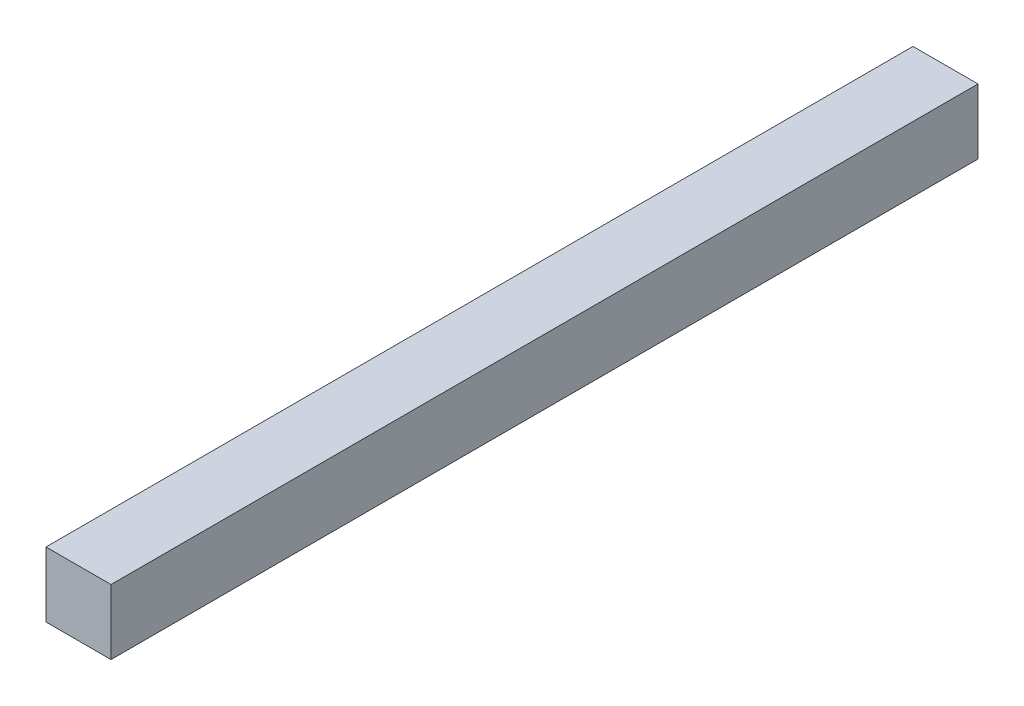
ISO-10303-21;
HEADER;
FILE_DESCRIPTION(('STEP AP214'),'2;1');
FILE_NAME('part.step','',(''),(''),'','','');
FILE_SCHEMA(('AUTOMOTIVE_DESIGN { 1 0 10303 214 1 1 1 1 }'));
ENDSEC;
DATA;
#1=APPLICATION_CONTEXT('core data for automotive mechanical design processes');
#2=APPLICATION_PROTOCOL_DEFINITION('international standard','automotive_design',2000,#1);
#3=PRODUCT_CONTEXT('',#1,'mechanical');
#4=PRODUCT('Part','Part','',(#3));
#5=PRODUCT_RELATED_PRODUCT_CATEGORY('part','',(#4));
#6=PRODUCT_DEFINITION_FORMATION('','',#4);
#7=PRODUCT_DEFINITION_CONTEXT('part definition',#1,'design');
#8=PRODUCT_DEFINITION('design','',#6,#7);
#9=PRODUCT_DEFINITION_SHAPE('','',#8);
#10=(LENGTH_UNIT() NAMED_UNIT(*) SI_UNIT(.MILLI.,.METRE.));
#11=(NAMED_UNIT(*) PLANE_ANGLE_UNIT() SI_UNIT($,.RADIAN.));
#12=(NAMED_UNIT(*) SI_UNIT($,.STERADIAN.) SOLID_ANGLE_UNIT());
#13=UNCERTAINTY_MEASURE_WITH_UNIT(LENGTH_MEASURE(1.E-05),#10,'distance_accuracy_value','');
#14=(GEOMETRIC_REPRESENTATION_CONTEXT(3) GLOBAL_UNCERTAINTY_ASSIGNED_CONTEXT((#13)) GLOBAL_UNIT_ASSIGNED_CONTEXT((#10,
#11,#12)) REPRESENTATION_CONTEXT('',''));
#15=CARTESIAN_POINT('',(0.,0.,0.));
#16=DIRECTION('',(0.,0.,1.));
#17=DIRECTION('',(1.,0.,0.));
#18=AXIS2_PLACEMENT_3D('',#15,#16,#17);
#19=CARTESIAN_POINT('',(-98.3544303797468,-0.0100000000000031,7.15189873417722));
#20=DIRECTION('',(0.,0.,1.));
#21=DIRECTION('',(1.,0.,0.));
#22=AXIS2_PLACEMENT_3D('',#19,#20,#21);
#23=PLANE('',#22);
#24=DIRECTION('',(0.,-1.,0.));
#25=VECTOR('',#24,1.);
#26=CARTESIAN_POINT('',(-98.3544303797468,50.,7.15189873417722));
#27=LINE('',#26,#25);
#28=CARTESIAN_POINT('',(-98.3544303797468,3.,7.15189873417722));
#29=VERTEX_POINT('',#28);
#30=CARTESIAN_POINT('',(-98.3544303797468,0.,7.15189873417722));
#31=VERTEX_POINT('',#30);
#32=EDGE_CURVE('E89',#29,#31,#27,.T.);
#33=ORIENTED_EDGE('',*,*,#32,.T.);
#34=DIRECTION('',(1.,0.,0.));
#35=VECTOR('',#34,1.);
#36=CARTESIAN_POINT('',(0.,0.,7.15189873417733));
#37=LINE('',#36,#35);
#38=CARTESIAN_POINT('',(-95.3544303797468,0.,7.15189873417722));
#39=VERTEX_POINT('',#38);
#40=EDGE_CURVE('E91',#31,#39,#37,.T.);
#41=ORIENTED_EDGE('',*,*,#40,.T.);
#42=DIRECTION('',(0.,1.,0.));
#43=VECTOR('',#42,1.);
#44=CARTESIAN_POINT('',(-95.3544303797468,-0.0100000000000031,7.15189873417722));
#45=LINE('',#44,#43);
#46=CARTESIAN_POINT('',(-95.3544303797468,3.,7.15189873417722));
#47=VERTEX_POINT('',#46);
#48=EDGE_CURVE('E41',#39,#47,#45,.T.);
#49=ORIENTED_EDGE('',*,*,#48,.T.);
#50=DIRECTION('',(1.,0.,0.));
#51=VECTOR('',#50,1.);
#52=CARTESIAN_POINT('',(0.,3.,7.15189873417733));
#53=LINE('',#52,#51);
#54=EDGE_CURVE('E78',#29,#47,#53,.T.);
#55=ORIENTED_EDGE('',*,*,#54,.F.);
#56=EDGE_LOOP('',(#33,#41,#49,#55));
#57=FACE_BOUND('',#56,.T.);
#58=ADVANCED_FACE('F32',(#57),#23,.T.);
#59=CARTESIAN_POINT('',(-98.3544303797468,-0.0100000000000031,-32.8481012658228));
#60=DIRECTION('',(0.,0.,-1.));
#61=DIRECTION('',(-1.,0.,0.));
#62=AXIS2_PLACEMENT_3D('',#59,#60,#61);
#63=PLANE('',#62);
#64=DIRECTION('',(0.,1.,0.));
#65=VECTOR('',#64,1.);
#66=CARTESIAN_POINT('',(-95.3544303797468,-0.0100000000000031,-32.8481012658228));
#67=LINE('',#66,#65);
#68=CARTESIAN_POINT('',(-95.3544303797468,0.,-32.8481012658228));
#69=VERTEX_POINT('',#68);
#70=CARTESIAN_POINT('',(-95.3544303797468,3.,-32.8481012658228));
#71=VERTEX_POINT('',#70);
#72=EDGE_CURVE('E11',#69,#71,#67,.T.);
#73=ORIENTED_EDGE('',*,*,#72,.F.);
#74=DIRECTION('',(-1.,0.,0.));
#75=VECTOR('',#74,1.);
#76=CARTESIAN_POINT('',(0.,0.,-32.8481012658228));
#77=LINE('',#76,#75);
#78=CARTESIAN_POINT('',(-98.3544303797468,0.,-32.8481012658228));
#79=VERTEX_POINT('',#78);
#80=EDGE_CURVE('E95',#69,#79,#77,.T.);
#81=ORIENTED_EDGE('',*,*,#80,.T.);
#82=DIRECTION('',(0.,1.,0.));
#83=VECTOR('',#82,1.);
#84=CARTESIAN_POINT('',(-98.3544303797468,50.,-32.8481012658228));
#85=LINE('',#84,#83);
#86=CARTESIAN_POINT('',(-98.3544303797468,3.,-32.8481012658228));
#87=VERTEX_POINT('',#86);
#88=EDGE_CURVE('E36',#79,#87,#85,.T.);
#89=ORIENTED_EDGE('',*,*,#88,.T.);
#90=DIRECTION('',(-1.,0.,0.));
#91=VECTOR('',#90,1.);
#92=CARTESIAN_POINT('',(0.,3.,-32.8481012658228));
#93=LINE('',#92,#91);
#94=EDGE_CURVE('E79',#71,#87,#93,.T.);
#95=ORIENTED_EDGE('',*,*,#94,.F.);
#96=EDGE_LOOP('',(#73,#81,#89,#95));
#97=FACE_BOUND('',#96,.T.);
#98=ADVANCED_FACE('F105',(#97),#63,.T.);
#99=CARTESIAN_POINT('',(-95.3544303797468,-0.0100000000000031,-32.8481012658228));
#100=DIRECTION('',(1.,0.,0.));
#101=DIRECTION('',(0.,0.,-1.));
#102=AXIS2_PLACEMENT_3D('',#99,#100,#101);
#103=PLANE('',#102);
#104=ORIENTED_EDGE('',*,*,#48,.F.);
#105=DIRECTION('',(0.,0.,-1.));
#106=VECTOR('',#105,1.);
#107=CARTESIAN_POINT('',(-95.3544303797468,0.,0.));
#108=LINE('',#107,#106);
#109=EDGE_CURVE('E96',#39,#69,#108,.T.);
#110=ORIENTED_EDGE('',*,*,#109,.T.);
#111=ORIENTED_EDGE('',*,*,#72,.T.);
#112=DIRECTION('',(0.,0.,-1.));
#113=VECTOR('',#112,1.);
#114=CARTESIAN_POINT('',(-95.3544303797468,3.,0.));
#115=LINE('',#114,#113);
#116=EDGE_CURVE('E90',#47,#71,#115,.T.);
#117=ORIENTED_EDGE('',*,*,#116,.F.);
#118=EDGE_LOOP('',(#104,#110,#111,#117));
#119=FACE_BOUND('',#118,.T.);
#120=ADVANCED_FACE('F104',(#119),#103,.T.);
#121=CARTESIAN_POINT('',(-98.3544303797468,50.,-47.8481012658228));
#122=DIRECTION('',(1.,0.,0.));
#123=DIRECTION('',(0.,0.,-1.));
#124=AXIS2_PLACEMENT_3D('',#121,#122,#123);
#125=PLANE('',#124);
#126=ORIENTED_EDGE('',*,*,#32,.F.);
#127=DIRECTION('',(0.,0.,-1.));
#128=VECTOR('',#127,1.);
#129=CARTESIAN_POINT('',(-98.3544303797468,3.,-47.8481012658228));
#130=LINE('',#129,#128);
#131=EDGE_CURVE('E74',#29,#87,#130,.T.);
#132=ORIENTED_EDGE('',*,*,#131,.T.);
#133=ORIENTED_EDGE('',*,*,#88,.F.);
#134=DIRECTION('',(0.,0.,1.));
#135=VECTOR('',#134,1.);
#136=CARTESIAN_POINT('',(-98.3544303797468,0.,-47.8481012658228));
#137=LINE('',#136,#135);
#138=EDGE_CURVE('E84',#79,#31,#137,.T.);
#139=ORIENTED_EDGE('',*,*,#138,.T.);
#140=EDGE_LOOP('',(#126,#132,#133,#139));
#141=FACE_BOUND('',#140,.T.);
#142=ADVANCED_FACE('F93',(#141),#125,.F.);
#143=CARTESIAN_POINT('',(0.,3.,0.));
#144=DIRECTION('',(0.,1.,0.));
#145=DIRECTION('',(0.,0.,1.));
#146=AXIS2_PLACEMENT_3D('',#143,#144,#145);
#147=PLANE('',#146);
#148=ORIENTED_EDGE('',*,*,#131,.F.);
#149=ORIENTED_EDGE('',*,*,#54,.T.);
#150=ORIENTED_EDGE('',*,*,#116,.T.);
#151=ORIENTED_EDGE('',*,*,#94,.T.);
#152=EDGE_LOOP('',(#148,#149,#150,#151));
#153=FACE_BOUND('',#152,.T.);
#154=ADVANCED_FACE('F76',(#153),#147,.T.);
#155=CARTESIAN_POINT('',(0.,0.,0.));
#156=DIRECTION('',(0.,1.,0.));
#157=DIRECTION('',(0.,0.,1.));
#158=AXIS2_PLACEMENT_3D('',#155,#156,#157);
#159=PLANE('',#158);
#160=ORIENTED_EDGE('',*,*,#40,.F.);
#161=ORIENTED_EDGE('',*,*,#138,.F.);
#162=ORIENTED_EDGE('',*,*,#80,.F.);
#163=ORIENTED_EDGE('',*,*,#109,.F.);
#164=EDGE_LOOP('',(#160,#161,#162,#163));
#165=FACE_BOUND('',#164,.T.);
#166=ADVANCED_FACE('F34',(#165),#159,.F.);
#167=CLOSED_SHELL('',(#58,#98,#120,#142,#154,#166));
#168=MANIFOLD_SOLID_BREP('B2',#167);
#169=ADVANCED_BREP_SHAPE_REPRESENTATION('',(#18,#168),#14);
#170=SHAPE_DEFINITION_REPRESENTATION(#9,#169);
ENDSEC;
END-ISO-10303-21;
